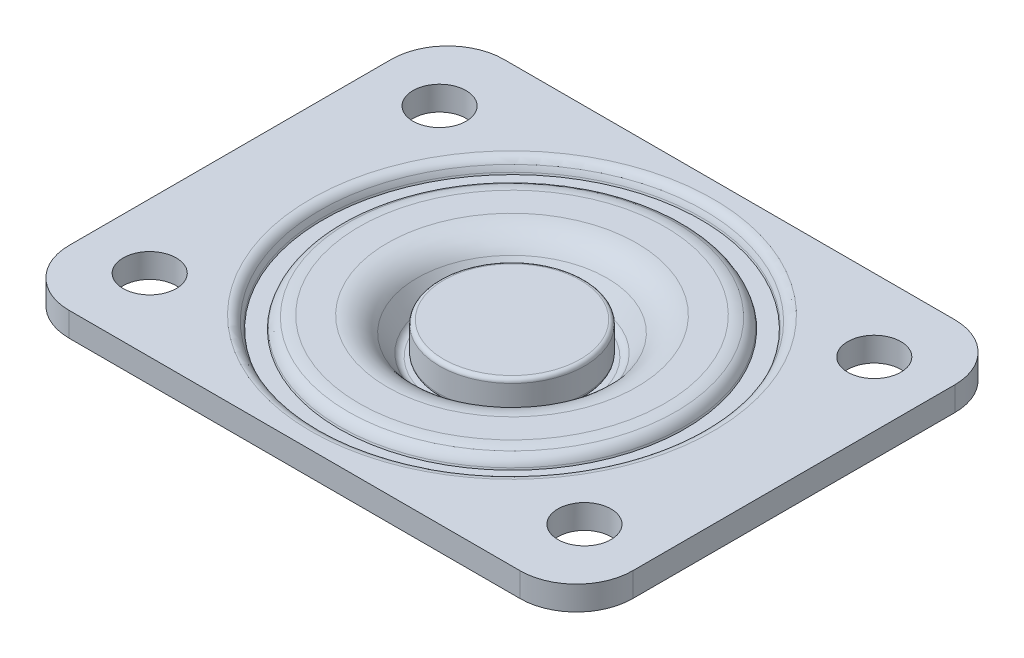
ISO-10303-21;
HEADER;
FILE_DESCRIPTION(('STEP AP214'),'2;1');
FILE_NAME('part.step','',(''),(''),'','','');
FILE_SCHEMA(('AUTOMOTIVE_DESIGN { 1 0 10303 214 1 1 1 1 }'));
ENDSEC;
DATA;
#1=APPLICATION_CONTEXT('core data for automotive mechanical design processes');
#2=APPLICATION_PROTOCOL_DEFINITION('international standard','automotive_design',2000,#1);
#3=PRODUCT_CONTEXT('',#1,'mechanical');
#4=PRODUCT('Part','Part','',(#3));
#5=PRODUCT_RELATED_PRODUCT_CATEGORY('part','',(#4));
#6=PRODUCT_DEFINITION_FORMATION('','',#4);
#7=PRODUCT_DEFINITION_CONTEXT('part definition',#1,'design');
#8=PRODUCT_DEFINITION('design','',#6,#7);
#9=PRODUCT_DEFINITION_SHAPE('','',#8);
#10=(LENGTH_UNIT() NAMED_UNIT(*) SI_UNIT(.MILLI.,.METRE.));
#11=(NAMED_UNIT(*) PLANE_ANGLE_UNIT() SI_UNIT($,.RADIAN.));
#12=(NAMED_UNIT(*) SI_UNIT($,.STERADIAN.) SOLID_ANGLE_UNIT());
#13=UNCERTAINTY_MEASURE_WITH_UNIT(LENGTH_MEASURE(1.E-05),#10,'distance_accuracy_value','');
#14=(GEOMETRIC_REPRESENTATION_CONTEXT(3) GLOBAL_UNCERTAINTY_ASSIGNED_CONTEXT((#13)) GLOBAL_UNIT_ASSIGNED_CONTEXT((#10,
#11,#12)) REPRESENTATION_CONTEXT('',''));
#15=CARTESIAN_POINT('',(0.,0.,0.));
#16=DIRECTION('',(0.,0.,1.));
#17=DIRECTION('',(1.,0.,0.));
#18=AXIS2_PLACEMENT_3D('',#15,#16,#17);
#19=CARTESIAN_POINT('',(0.,3.,0.));
#20=DIRECTION('',(0.,-1.,0.));
#21=DIRECTION('',(0.,0.,-1.));
#22=AXIS2_PLACEMENT_3D('',#19,#20,#21);
#23=PLANE('',#22);
#24=CARTESIAN_POINT('',(-27.,3.,18.));
#25=DIRECTION('',(0.,1.,0.));
#26=DIRECTION('',(0.,0.,1.));
#27=AXIS2_PLACEMENT_3D('',#24,#25,#26);
#28=CIRCLE('',#27,3.3);
#29=CARTESIAN_POINT('',(-27.,3.,21.3));
#30=VERTEX_POINT('',#29);
#31=EDGE_CURVE('E193',#30,#30,#28,.T.);
#32=ORIENTED_EDGE('',*,*,#31,.F.);
#33=EDGE_LOOP('',(#32));
#34=FACE_BOUND('',#33,.T.);
#35=CARTESIAN_POINT('',(27.,3.,18.));
#36=DIRECTION('',(0.,1.,0.));
#37=DIRECTION('',(0.,0.,1.));
#38=AXIS2_PLACEMENT_3D('',#35,#36,#37);
#39=CIRCLE('',#38,3.3);
#40=CARTESIAN_POINT('',(27.,3.,21.3));
#41=VERTEX_POINT('',#40);
#42=EDGE_CURVE('E189',#41,#41,#39,.T.);
#43=ORIENTED_EDGE('',*,*,#42,.F.);
#44=EDGE_LOOP('',(#43));
#45=FACE_BOUND('',#44,.T.);
#46=CARTESIAN_POINT('',(27.,3.,-18.));
#47=DIRECTION('',(0.,1.,0.));
#48=DIRECTION('',(0.,0.,1.));
#49=AXIS2_PLACEMENT_3D('',#46,#47,#48);
#50=CIRCLE('',#49,3.3);
#51=CARTESIAN_POINT('',(27.,3.,-14.7));
#52=VERTEX_POINT('',#51);
#53=EDGE_CURVE('E185',#52,#52,#50,.T.);
#54=ORIENTED_EDGE('',*,*,#53,.F.);
#55=EDGE_LOOP('',(#54));
#56=FACE_BOUND('',#55,.T.);
#57=CARTESIAN_POINT('',(-27.,3.,-18.));
#58=DIRECTION('',(0.,1.,0.));
#59=DIRECTION('',(0.,0.,1.));
#60=AXIS2_PLACEMENT_3D('',#57,#58,#59);
#61=CIRCLE('',#60,3.3);
#62=CARTESIAN_POINT('',(-27.,3.,-14.7));
#63=VERTEX_POINT('',#62);
#64=EDGE_CURVE('E181',#63,#63,#61,.T.);
#65=ORIENTED_EDGE('',*,*,#64,.F.);
#66=EDGE_LOOP('',(#65));
#67=FACE_BOUND('',#66,.T.);
#68=DIRECTION('',(0.,0.,-1.));
#69=VECTOR('',#68,1.);
#70=CARTESIAN_POINT('',(35.,3.,27.));
#71=LINE('',#70,#69);
#72=CARTESIAN_POINT('',(35.,3.,20.));
#73=VERTEX_POINT('',#72);
#74=CARTESIAN_POINT('',(35.,3.,-20.));
#75=VERTEX_POINT('',#74);
#76=EDGE_CURVE('E139',#73,#75,#71,.T.);
#77=ORIENTED_EDGE('',*,*,#76,.T.);
#78=CARTESIAN_POINT('',(28.,3.,-20.));
#79=DIRECTION('',(0.,-1.,0.));
#80=DIRECTION('',(0.,0.,-1.));
#81=AXIS2_PLACEMENT_3D('',#78,#79,#80);
#82=CIRCLE('',#81,7.);
#83=CARTESIAN_POINT('',(28.,3.,-27.));
#84=VERTEX_POINT('',#83);
#85=EDGE_CURVE('E165',#75,#84,#82,.F.);
#86=ORIENTED_EDGE('',*,*,#85,.T.);
#87=DIRECTION('',(-1.,0.,0.));
#88=VECTOR('',#87,1.);
#89=CARTESIAN_POINT('',(-35.,3.,-27.));
#90=LINE('',#89,#88);
#91=CARTESIAN_POINT('',(-28.,3.,-27.));
#92=VERTEX_POINT('',#91);
#93=EDGE_CURVE('E121',#84,#92,#90,.T.);
#94=ORIENTED_EDGE('',*,*,#93,.T.);
#95=CARTESIAN_POINT('',(-28.,3.,-20.));
#96=DIRECTION('',(0.,-1.,0.));
#97=DIRECTION('',(0.,0.,-1.));
#98=AXIS2_PLACEMENT_3D('',#95,#96,#97);
#99=CIRCLE('',#98,7.);
#100=CARTESIAN_POINT('',(-35.,3.,-20.));
#101=VERTEX_POINT('',#100);
#102=EDGE_CURVE('E161',#92,#101,#99,.F.);
#103=ORIENTED_EDGE('',*,*,#102,.T.);
#104=DIRECTION('',(0.,0.,1.));
#105=VECTOR('',#104,1.);
#106=CARTESIAN_POINT('',(-35.,3.,27.));
#107=LINE('',#106,#105);
#108=CARTESIAN_POINT('',(-35.,3.,20.));
#109=VERTEX_POINT('',#108);
#110=EDGE_CURVE('E307',#101,#109,#107,.T.);
#111=ORIENTED_EDGE('',*,*,#110,.T.);
#112=CARTESIAN_POINT('',(-28.,3.,20.));
#113=DIRECTION('',(0.,-1.,0.));
#114=DIRECTION('',(0.,0.,-1.));
#115=AXIS2_PLACEMENT_3D('',#112,#113,#114);
#116=CIRCLE('',#115,7.);
#117=CARTESIAN_POINT('',(-28.,3.,27.));
#118=VERTEX_POINT('',#117);
#119=EDGE_CURVE('E56',#109,#118,#116,.F.);
#120=ORIENTED_EDGE('',*,*,#119,.T.);
#121=DIRECTION('',(1.,0.,0.));
#122=VECTOR('',#121,1.);
#123=CARTESIAN_POINT('',(-35.,3.,27.));
#124=LINE('',#123,#122);
#125=CARTESIAN_POINT('',(28.,3.,27.));
#126=VERTEX_POINT('',#125);
#127=EDGE_CURVE('E144',#118,#126,#124,.T.);
#128=ORIENTED_EDGE('',*,*,#127,.T.);
#129=CARTESIAN_POINT('',(28.,3.,20.));
#130=DIRECTION('',(0.,-1.,0.));
#131=DIRECTION('',(0.,0.,-1.));
#132=AXIS2_PLACEMENT_3D('',#129,#130,#131);
#133=CIRCLE('',#132,7.);
#134=EDGE_CURVE('E163',#126,#73,#133,.F.);
#135=ORIENTED_EDGE('',*,*,#134,.T.);
#136=EDGE_LOOP('',(#77,#86,#94,#103,#111,#120,#128,#135));
#137=FACE_BOUND('',#136,.T.);
#138=CARTESIAN_POINT('',(0.,3.,0.));
#139=DIRECTION('',(0.,1.,0.));
#140=DIRECTION('',(0.,0.,1.));
#141=AXIS2_PLACEMENT_3D('',#138,#139,#140);
#142=CIRCLE('',#141,24.987277463445);
#143=CARTESIAN_POINT('',(0.,3.,24.987277463445));
#144=VERTEX_POINT('',#143);
#145=EDGE_CURVE('E264',#144,#144,#142,.T.);
#146=ORIENTED_EDGE('',*,*,#145,.F.);
#147=EDGE_LOOP('',(#146));
#148=FACE_BOUND('',#147,.T.);
#149=ADVANCED_FACE('F34',(#34,#45,#56,#67,#137,#148),#23,.F.);
#150=CARTESIAN_POINT('',(0.,0.,0.));
#151=DIRECTION('',(0.,-1.,0.));
#152=DIRECTION('',(0.,0.,-1.));
#153=AXIS2_PLACEMENT_3D('',#150,#151,#152);
#154=PLANE('',#153);
#155=CARTESIAN_POINT('',(0.,0.,0.));
#156=DIRECTION('',(0.,-1.,0.));
#157=DIRECTION('',(0.,0.,-1.));
#158=AXIS2_PLACEMENT_3D('',#155,#156,#157);
#159=CIRCLE('',#158,20.0013248654052);
#160=CARTESIAN_POINT('',(0.,0.,-20.0013248654052));
#161=VERTEX_POINT('',#160);
#162=EDGE_CURVE('E214',#161,#161,#159,.T.);
#163=ORIENTED_EDGE('',*,*,#162,.T.);
#164=EDGE_LOOP('',(#163));
#165=FACE_BOUND('',#164,.T.);
#166=CARTESIAN_POINT('',(0.,0.,0.));
#167=DIRECTION('',(0.,-1.,0.));
#168=DIRECTION('',(0.,0.,-1.));
#169=AXIS2_PLACEMENT_3D('',#166,#167,#168);
#170=CIRCLE('',#169,15.5308505758276);
#171=CARTESIAN_POINT('',(0.,0.,-15.5308505758276));
#172=VERTEX_POINT('',#171);
#173=EDGE_CURVE('E150',#172,#172,#170,.F.);
#174=ORIENTED_EDGE('',*,*,#173,.T.);
#175=EDGE_LOOP('',(#174));
#176=FACE_BOUND('',#175,.T.);
#177=ADVANCED_FACE('F231',(#165,#176),#154,.T.);
#178=CARTESIAN_POINT('',(-5.,-15.5,0.));
#179=DIRECTION('',(0.,1.,0.));
#180=DIRECTION('',(0.,0.,1.));
#181=AXIS2_PLACEMENT_3D('',#178,#179,#180);
#182=PLANE('',#181);
#183=CARTESIAN_POINT('',(0.,-15.5,0.));
#184=DIRECTION('',(0.,-1.,0.));
#185=DIRECTION('',(0.,0.,-1.));
#186=AXIS2_PLACEMENT_3D('',#183,#184,#185);
#187=CIRCLE('',#186,5.);
#188=CARTESIAN_POINT('',(0.,-15.5,-5.));
#189=VERTEX_POINT('',#188);
#190=EDGE_CURVE('E134',#189,#189,#187,.T.);
#191=ORIENTED_EDGE('',*,*,#190,.T.);
#192=EDGE_LOOP('',(#191));
#193=FACE_BOUND('',#192,.T.);
#194=ADVANCED_FACE('F238',(#193),#182,.F.);
#195=CARTESIAN_POINT('',(0.,-15.5,0.));
#196=DIRECTION('',(0.,-1.,0.));
#197=DIRECTION('',(0.,0.,-1.));
#198=AXIS2_PLACEMENT_3D('',#195,#196,#197);
#199=CYLINDRICAL_SURFACE('',#198,5.);
#200=ORIENTED_EDGE('',*,*,#190,.F.);
#201=EDGE_LOOP('',(#200));
#202=FACE_BOUND('',#201,.T.);
#203=CARTESIAN_POINT('',(0.,-4.5,0.));
#204=DIRECTION('',(0.,-1.,0.));
#205=DIRECTION('',(0.,0.,-1.));
#206=AXIS2_PLACEMENT_3D('',#203,#204,#205);
#207=CIRCLE('',#206,5.);
#208=CARTESIAN_POINT('',(0.,-4.5,-5.));
#209=VERTEX_POINT('',#208);
#210=EDGE_CURVE('E299',#209,#209,#207,.T.);
#211=ORIENTED_EDGE('',*,*,#210,.T.);
#212=EDGE_LOOP('',(#211));
#213=FACE_BOUND('',#212,.T.);
#214=ADVANCED_FACE('F395',(#202,#213),#199,.T.);
#215=CARTESIAN_POINT('',(-11.5990660780563,-4.5,0.));
#216=DIRECTION('',(0.,1.,0.));
#217=DIRECTION('',(0.,0.,1.));
#218=AXIS2_PLACEMENT_3D('',#215,#216,#217);
#219=PLANE('',#218);
#220=CARTESIAN_POINT('',(0.,-4.5,0.));
#221=DIRECTION('',(0.,1.,0.));
#222=DIRECTION('',(0.,0.,1.));
#223=AXIS2_PLACEMENT_3D('',#220,#221,#222);
#224=CIRCLE('',#223,9.51679787584933);
#225=CARTESIAN_POINT('',(0.,-4.5,9.51679787584933));
#226=VERTEX_POINT('',#225);
#227=EDGE_CURVE('E140',#226,#226,#224,.F.);
#228=ORIENTED_EDGE('',*,*,#227,.T.);
#229=EDGE_LOOP('',(#228));
#230=FACE_BOUND('',#229,.T.);
#231=ORIENTED_EDGE('',*,*,#210,.F.);
#232=EDGE_LOOP('',(#231));
#233=FACE_BOUND('',#232,.T.);
#234=ADVANCED_FACE('F391',(#230,#233),#219,.F.);
#235=CARTESIAN_POINT('',(0.,0.,0.));
#236=DIRECTION('',(0.,1.,0.));
#237=DIRECTION('',(0.,0.,1.));
#238=AXIS2_PLACEMENT_3D('',#235,#236,#237);
#239=CONICAL_SURFACE('',#238,14.75,0.610865238198013);
#240=CARTESIAN_POINT('',(0.,-0.639635345473434,0.));
#241=DIRECTION('',(0.,-1.,0.));
#242=DIRECTION('',(0.,0.,-1.));
#243=AXIS2_PLACEMENT_3D('',#240,#241,#242);
#244=CIRCLE('',#243,14.3021225093941);
#245=CARTESIAN_POINT('',(0.,-0.639635345473434,-14.3021225093941));
#246=VERTEX_POINT('',#245);
#247=EDGE_CURVE('E147',#246,#246,#244,.T.);
#248=ORIENTED_EDGE('',*,*,#247,.T.);
#249=EDGE_LOOP('',(#248));
#250=FACE_BOUND('',#249,.T.);
#251=CARTESIAN_POINT('',(0.,-2.79430574540418,0.));
#252=DIRECTION('',(0.,-1.,0.));
#253=DIRECTION('',(0.,0.,-1.));
#254=AXIS2_PLACEMENT_3D('',#251,#252,#253);
#255=CIRCLE('',#254,12.7934060530053);
#256=CARTESIAN_POINT('',(0.,-2.79430574540418,-12.7934060530053));
#257=VERTEX_POINT('',#256);
#258=EDGE_CURVE('E143',#257,#257,#255,.F.);
#259=ORIENTED_EDGE('',*,*,#258,.T.);
#260=EDGE_LOOP('',(#259));
#261=FACE_BOUND('',#260,.T.);
#262=ADVANCED_FACE('F387',(#250,#261),#239,.T.);
#263=CARTESIAN_POINT('',(0.,-0.5,0.));
#264=DIRECTION('',(0.,1.,0.));
#265=DIRECTION('',(0.,0.,1.));
#266=AXIS2_PLACEMENT_3D('',#263,#264,#265);
#267=TOROIDAL_SURFACE('',#266,9.51679787584933,4.);
#268=ORIENTED_EDGE('',*,*,#258,.F.);
#269=EDGE_LOOP('',(#268));
#270=FACE_BOUND('',#269,.T.);
#271=ORIENTED_EDGE('',*,*,#227,.F.);
#272=EDGE_LOOP('',(#271));
#273=FACE_BOUND('',#272,.T.);
#274=ADVANCED_FACE('F390',(#270,#273),#267,.T.);
#275=CARTESIAN_POINT('',(0.,-1.5,0.));
#276=DIRECTION('',(0.,-1.,0.));
#277=DIRECTION('',(0.,0.,-1.));
#278=AXIS2_PLACEMENT_3D('',#275,#276,#277);
#279=TOROIDAL_SURFACE('',#278,15.5308505758276,1.5);
#280=ORIENTED_EDGE('',*,*,#173,.F.);
#281=EDGE_LOOP('',(#280));
#282=FACE_BOUND('',#281,.T.);
#283=ORIENTED_EDGE('',*,*,#247,.F.);
#284=EDGE_LOOP('',(#283));
#285=FACE_BOUND('',#284,.T.);
#286=ADVANCED_FACE('F385',(#282,#285),#279,.F.);
#287=CARTESIAN_POINT('',(0.,0.,0.));
#288=DIRECTION('',(0.,-1.,0.));
#289=DIRECTION('',(0.,0.,-1.));
#290=AXIS2_PLACEMENT_3D('',#287,#288,#289);
#291=CONICAL_SURFACE('',#290,20.29,0.523598775598298);
#292=CARTESIAN_POINT('',(0.,-0.249999999999993,0.));
#293=DIRECTION('',(0.,1.,0.));
#294=DIRECTION('',(0.,0.,1.));
#295=AXIS2_PLACEMENT_3D('',#292,#293,#294);
#296=CIRCLE('',#295,20.4343375672974);
#297=CARTESIAN_POINT('',(0.,-0.249999999999993,20.4343375672974));
#298=VERTEX_POINT('',#297);
#299=EDGE_CURVE('E211',#298,#298,#296,.T.);
#300=ORIENTED_EDGE('',*,*,#299,.T.);
#301=EDGE_LOOP('',(#300));
#302=FACE_BOUND('',#301,.T.);
#303=CARTESIAN_POINT('',(0.,-0.367473300878593,0.));
#304=DIRECTION('',(0.,1.,0.));
#305=DIRECTION('',(0.,0.,1.));
#306=AXIS2_PLACEMENT_3D('',#303,#304,#305);
#307=CIRCLE('',#306,20.5021608091823);
#308=CARTESIAN_POINT('',(0.,-0.367473300878593,20.5021608091823));
#309=VERTEX_POINT('',#308);
#310=EDGE_CURVE('E296',#309,#309,#307,.T.);
#311=ORIENTED_EDGE('',*,*,#310,.F.);
#312=EDGE_LOOP('',(#311));
#313=FACE_BOUND('',#312,.T.);
#314=ADVANCED_FACE('F381',(#302,#313),#291,.F.);
#315=CARTESIAN_POINT('',(0.,0.797526699121403,0.));
#316=DIRECTION('',(0.,1.,0.));
#317=DIRECTION('',(0.,0.,1.));
#318=AXIS2_PLACEMENT_3D('',#315,#316,#317);
#319=TOROIDAL_SURFACE('',#318,22.52,2.33);
#320=CARTESIAN_POINT('',(0.,-0.367473300878607,0.));
#321=DIRECTION('',(0.,1.,0.));
#322=DIRECTION('',(0.,0.,1.));
#323=AXIS2_PLACEMENT_3D('',#320,#321,#322);
#324=CIRCLE('',#323,24.5378391908177);
#325=CARTESIAN_POINT('',(0.,-0.367473300878607,24.5378391908177));
#326=VERTEX_POINT('',#325);
#327=EDGE_CURVE('E293',#326,#326,#324,.T.);
#328=ORIENTED_EDGE('',*,*,#327,.F.);
#329=EDGE_LOOP('',(#328));
#330=FACE_BOUND('',#329,.T.);
#331=ORIENTED_EDGE('',*,*,#310,.T.);
#332=EDGE_LOOP('',(#331));
#333=FACE_BOUND('',#332,.T.);
#334=ADVANCED_FACE('F337',(#330,#333),#319,.T.);
#335=CARTESIAN_POINT('',(0.,-0.367473300878607,0.));
#336=DIRECTION('',(0.,1.,0.));
#337=DIRECTION('',(0.,0.,1.));
#338=AXIS2_PLACEMENT_3D('',#335,#336,#337);
#339=CONICAL_SURFACE('',#338,24.5378391908177,0.523598775598302);
#340=CARTESIAN_POINT('',(0.,-0.25,0.));
#341=DIRECTION('',(0.,-1.,0.));
#342=DIRECTION('',(0.,0.,-1.));
#343=AXIS2_PLACEMENT_3D('',#340,#341,#342);
#344=CIRCLE('',#343,24.6056624327026);
#345=CARTESIAN_POINT('',(0.,-0.25,-24.6056624327026));
#346=VERTEX_POINT('',#345);
#347=EDGE_CURVE('E11',#346,#346,#344,.T.);
#348=ORIENTED_EDGE('',*,*,#347,.T.);
#349=EDGE_LOOP('',(#348));
#350=FACE_BOUND('',#349,.T.);
#351=ORIENTED_EDGE('',*,*,#327,.T.);
#352=EDGE_LOOP('',(#351));
#353=FACE_BOUND('',#352,.T.);
#354=ADVANCED_FACE('F330',(#350,#353),#339,.T.);
#355=CARTESIAN_POINT('',(-28.,3.,-20.));
#356=DIRECTION('',(0.,-1.,0.));
#357=DIRECTION('',(0.,0.,-1.));
#358=AXIS2_PLACEMENT_3D('',#355,#356,#357);
#359=CYLINDRICAL_SURFACE('',#358,7.);
#360=ORIENTED_EDGE('',*,*,#102,.F.);
#361=DIRECTION('',(0.,-1.,0.));
#362=VECTOR('',#361,1.);
#363=CARTESIAN_POINT('',(-28.,3.,-27.));
#364=LINE('',#363,#362);
#365=CARTESIAN_POINT('',(-28.,0.,-27.));
#366=VERTEX_POINT('',#365);
#367=EDGE_CURVE('E123',#366,#92,#364,.F.);
#368=ORIENTED_EDGE('',*,*,#367,.F.);
#369=CARTESIAN_POINT('',(-28.,0.,-20.));
#370=DIRECTION('',(0.,-1.,0.));
#371=DIRECTION('',(0.,0.,-1.));
#372=AXIS2_PLACEMENT_3D('',#369,#370,#371);
#373=CIRCLE('',#372,7.);
#374=CARTESIAN_POINT('',(-35.,0.,-20.));
#375=VERTEX_POINT('',#374);
#376=EDGE_CURVE('E127',#375,#366,#373,.T.);
#377=ORIENTED_EDGE('',*,*,#376,.F.);
#378=DIRECTION('',(0.,-1.,0.));
#379=VECTOR('',#378,1.);
#380=CARTESIAN_POINT('',(-35.,3.,-20.));
#381=LINE('',#380,#379);
#382=EDGE_CURVE('E173',#101,#375,#381,.T.);
#383=ORIENTED_EDGE('',*,*,#382,.F.);
#384=EDGE_LOOP('',(#360,#368,#377,#383));
#385=FACE_BOUND('',#384,.T.);
#386=ADVANCED_FACE('F328',(#385),#359,.T.);
#387=CARTESIAN_POINT('',(-35.,3.,27.));
#388=DIRECTION('',(1.,0.,0.));
#389=DIRECTION('',(0.,0.,-1.));
#390=AXIS2_PLACEMENT_3D('',#387,#388,#389);
#391=PLANE('',#390);
#392=ORIENTED_EDGE('',*,*,#110,.F.);
#393=ORIENTED_EDGE('',*,*,#382,.T.);
#394=DIRECTION('',(0.,0.,1.));
#395=VECTOR('',#394,1.);
#396=CARTESIAN_POINT('',(-35.,0.,27.));
#397=LINE('',#396,#395);
#398=CARTESIAN_POINT('',(-35.,0.,20.));
#399=VERTEX_POINT('',#398);
#400=EDGE_CURVE('E128',#375,#399,#397,.T.);
#401=ORIENTED_EDGE('',*,*,#400,.T.);
#402=DIRECTION('',(0.,-1.,0.));
#403=VECTOR('',#402,1.);
#404=CARTESIAN_POINT('',(-35.,3.,20.));
#405=LINE('',#404,#403);
#406=EDGE_CURVE('E171',#399,#109,#405,.F.);
#407=ORIENTED_EDGE('',*,*,#406,.T.);
#408=EDGE_LOOP('',(#392,#393,#401,#407));
#409=FACE_BOUND('',#408,.T.);
#410=ADVANCED_FACE('F324',(#409),#391,.F.);
#411=CARTESIAN_POINT('',(-28.,3.,20.));
#412=DIRECTION('',(0.,-1.,0.));
#413=DIRECTION('',(0.,0.,-1.));
#414=AXIS2_PLACEMENT_3D('',#411,#412,#413);
#415=CYLINDRICAL_SURFACE('',#414,7.);
#416=ORIENTED_EDGE('',*,*,#119,.F.);
#417=ORIENTED_EDGE('',*,*,#406,.F.);
#418=CARTESIAN_POINT('',(-28.,0.,20.));
#419=DIRECTION('',(0.,-1.,0.));
#420=DIRECTION('',(0.,0.,-1.));
#421=AXIS2_PLACEMENT_3D('',#418,#419,#420);
#422=CIRCLE('',#421,7.);
#423=CARTESIAN_POINT('',(-28.,0.,27.));
#424=VERTEX_POINT('',#423);
#425=EDGE_CURVE('E122',#424,#399,#422,.T.);
#426=ORIENTED_EDGE('',*,*,#425,.F.);
#427=DIRECTION('',(0.,-1.,0.));
#428=VECTOR('',#427,1.);
#429=CARTESIAN_POINT('',(-28.,3.,27.));
#430=LINE('',#429,#428);
#431=EDGE_CURVE('E167',#118,#424,#430,.T.);
#432=ORIENTED_EDGE('',*,*,#431,.F.);
#433=EDGE_LOOP('',(#416,#417,#426,#432));
#434=FACE_BOUND('',#433,.T.);
#435=ADVANCED_FACE('F320',(#434),#415,.T.);
#436=CARTESIAN_POINT('',(-35.,3.,27.));
#437=DIRECTION('',(0.,0.,-1.));
#438=DIRECTION('',(-1.,0.,0.));
#439=AXIS2_PLACEMENT_3D('',#436,#437,#438);
#440=PLANE('',#439);
#441=DIRECTION('',(1.,0.,0.));
#442=VECTOR('',#441,1.);
#443=CARTESIAN_POINT('',(-35.,0.,27.));
#444=LINE('',#443,#442);
#445=CARTESIAN_POINT('',(28.,0.,27.));
#446=VERTEX_POINT('',#445);
#447=EDGE_CURVE('E132',#424,#446,#444,.T.);
#448=ORIENTED_EDGE('',*,*,#447,.T.);
#449=DIRECTION('',(0.,-1.,0.));
#450=VECTOR('',#449,1.);
#451=CARTESIAN_POINT('',(28.,3.,27.));
#452=LINE('',#451,#450);
#453=EDGE_CURVE('E49',#446,#126,#452,.F.);
#454=ORIENTED_EDGE('',*,*,#453,.T.);
#455=ORIENTED_EDGE('',*,*,#127,.F.);
#456=ORIENTED_EDGE('',*,*,#431,.T.);
#457=EDGE_LOOP('',(#448,#454,#455,#456));
#458=FACE_BOUND('',#457,.T.);
#459=ADVANCED_FACE('F318',(#458),#440,.F.);
#460=CARTESIAN_POINT('',(28.,3.,20.));
#461=DIRECTION('',(0.,-1.,0.));
#462=DIRECTION('',(0.,0.,-1.));
#463=AXIS2_PLACEMENT_3D('',#460,#461,#462);
#464=CYLINDRICAL_SURFACE('',#463,7.);
#465=ORIENTED_EDGE('',*,*,#134,.F.);
#466=ORIENTED_EDGE('',*,*,#453,.F.);
#467=CARTESIAN_POINT('',(28.,0.,20.));
#468=DIRECTION('',(0.,-1.,0.));
#469=DIRECTION('',(0.,0.,-1.));
#470=AXIS2_PLACEMENT_3D('',#467,#468,#469);
#471=CIRCLE('',#470,7.);
#472=CARTESIAN_POINT('',(35.,0.,20.));
#473=VERTEX_POINT('',#472);
#474=EDGE_CURVE('E112',#473,#446,#471,.T.);
#475=ORIENTED_EDGE('',*,*,#474,.F.);
#476=DIRECTION('',(0.,-1.,0.));
#477=VECTOR('',#476,1.);
#478=CARTESIAN_POINT('',(35.,3.,20.));
#479=LINE('',#478,#477);
#480=EDGE_CURVE('E111',#73,#473,#479,.T.);
#481=ORIENTED_EDGE('',*,*,#480,.F.);
#482=EDGE_LOOP('',(#465,#466,#475,#481));
#483=FACE_BOUND('',#482,.T.);
#484=ADVANCED_FACE('F314',(#483),#464,.T.);
#485=CARTESIAN_POINT('',(35.,3.,27.));
#486=DIRECTION('',(-1.,0.,0.));
#487=DIRECTION('',(0.,0.,1.));
#488=AXIS2_PLACEMENT_3D('',#485,#486,#487);
#489=PLANE('',#488);
#490=DIRECTION('',(0.,0.,-1.));
#491=VECTOR('',#490,1.);
#492=CARTESIAN_POINT('',(35.,0.,27.));
#493=LINE('',#492,#491);
#494=CARTESIAN_POINT('',(35.,0.,-20.));
#495=VERTEX_POINT('',#494);
#496=EDGE_CURVE('E129',#473,#495,#493,.T.);
#497=ORIENTED_EDGE('',*,*,#496,.T.);
#498=DIRECTION('',(0.,-1.,0.));
#499=VECTOR('',#498,1.);
#500=CARTESIAN_POINT('',(35.,3.,-20.));
#501=LINE('',#500,#499);
#502=EDGE_CURVE('E106',#495,#75,#501,.F.);
#503=ORIENTED_EDGE('',*,*,#502,.T.);
#504=ORIENTED_EDGE('',*,*,#76,.F.);
#505=ORIENTED_EDGE('',*,*,#480,.T.);
#506=EDGE_LOOP('',(#497,#503,#504,#505));
#507=FACE_BOUND('',#506,.T.);
#508=ADVANCED_FACE('F316',(#507),#489,.F.);
#509=CARTESIAN_POINT('',(28.,3.,-20.));
#510=DIRECTION('',(0.,-1.,0.));
#511=DIRECTION('',(0.,0.,-1.));
#512=AXIS2_PLACEMENT_3D('',#509,#510,#511);
#513=CYLINDRICAL_SURFACE('',#512,7.);
#514=ORIENTED_EDGE('',*,*,#85,.F.);
#515=ORIENTED_EDGE('',*,*,#502,.F.);
#516=CARTESIAN_POINT('',(28.,0.,-20.));
#517=DIRECTION('',(0.,-1.,0.));
#518=DIRECTION('',(0.,0.,-1.));
#519=AXIS2_PLACEMENT_3D('',#516,#517,#518);
#520=CIRCLE('',#519,7.);
#521=CARTESIAN_POINT('',(28.,0.,-27.));
#522=VERTEX_POINT('',#521);
#523=EDGE_CURVE('E101',#522,#495,#520,.T.);
#524=ORIENTED_EDGE('',*,*,#523,.F.);
#525=DIRECTION('',(0.,-1.,0.));
#526=VECTOR('',#525,1.);
#527=CARTESIAN_POINT('',(28.,3.,-27.));
#528=LINE('',#527,#526);
#529=EDGE_CURVE('E105',#84,#522,#528,.T.);
#530=ORIENTED_EDGE('',*,*,#529,.F.);
#531=EDGE_LOOP('',(#514,#515,#524,#530));
#532=FACE_BOUND('',#531,.T.);
#533=ADVANCED_FACE('F104',(#532),#513,.T.);
#534=CARTESIAN_POINT('',(-35.,3.,-27.));
#535=DIRECTION('',(0.,0.,1.));
#536=DIRECTION('',(1.,0.,0.));
#537=AXIS2_PLACEMENT_3D('',#534,#535,#536);
#538=PLANE('',#537);
#539=ORIENTED_EDGE('',*,*,#93,.F.);
#540=ORIENTED_EDGE('',*,*,#529,.T.);
#541=DIRECTION('',(-1.,0.,0.));
#542=VECTOR('',#541,1.);
#543=CARTESIAN_POINT('',(-35.,0.,-27.));
#544=LINE('',#543,#542);
#545=EDGE_CURVE('E118',#522,#366,#544,.T.);
#546=ORIENTED_EDGE('',*,*,#545,.T.);
#547=ORIENTED_EDGE('',*,*,#367,.T.);
#548=EDGE_LOOP('',(#539,#540,#546,#547));
#549=FACE_BOUND('',#548,.T.);
#550=ADVANCED_FACE('F117',(#549),#538,.F.);
#551=CARTESIAN_POINT('',(0.,0.,0.));
#552=DIRECTION('',(0.,-1.,0.));
#553=DIRECTION('',(0.,0.,-1.));
#554=AXIS2_PLACEMENT_3D('',#551,#552,#553);
#555=CIRCLE('',#554,25.0386751345948);
#556=CARTESIAN_POINT('',(0.,0.,-25.0386751345948));
#557=VERTEX_POINT('',#556);
#558=EDGE_CURVE('E42',#557,#557,#555,.F.);
#559=ORIENTED_EDGE('',*,*,#558,.T.);
#560=EDGE_LOOP('',(#559));
#561=FACE_BOUND('',#560,.T.);
#562=CARTESIAN_POINT('',(-27.,0.,18.));
#563=DIRECTION('',(0.,-1.,0.));
#564=DIRECTION('',(0.,0.,-1.));
#565=AXIS2_PLACEMENT_3D('',#562,#563,#564);
#566=CIRCLE('',#565,3.3);
#567=CARTESIAN_POINT('',(-27.,0.,14.7));
#568=VERTEX_POINT('',#567);
#569=EDGE_CURVE('E190',#568,#568,#566,.T.);
#570=ORIENTED_EDGE('',*,*,#569,.F.);
#571=EDGE_LOOP('',(#570));
#572=FACE_BOUND('',#571,.T.);
#573=CARTESIAN_POINT('',(27.,0.,18.));
#574=DIRECTION('',(0.,-1.,0.));
#575=DIRECTION('',(0.,0.,-1.));
#576=AXIS2_PLACEMENT_3D('',#573,#574,#575);
#577=CIRCLE('',#576,3.3);
#578=CARTESIAN_POINT('',(27.,0.,14.7));
#579=VERTEX_POINT('',#578);
#580=EDGE_CURVE('E186',#579,#579,#577,.T.);
#581=ORIENTED_EDGE('',*,*,#580,.F.);
#582=EDGE_LOOP('',(#581));
#583=FACE_BOUND('',#582,.T.);
#584=CARTESIAN_POINT('',(27.,0.,-18.));
#585=DIRECTION('',(0.,-1.,0.));
#586=DIRECTION('',(0.,0.,-1.));
#587=AXIS2_PLACEMENT_3D('',#584,#585,#586);
#588=CIRCLE('',#587,3.3);
#589=CARTESIAN_POINT('',(27.,0.,-21.3));
#590=VERTEX_POINT('',#589);
#591=EDGE_CURVE('E182',#590,#590,#588,.T.);
#592=ORIENTED_EDGE('',*,*,#591,.F.);
#593=EDGE_LOOP('',(#592));
#594=FACE_BOUND('',#593,.T.);
#595=CARTESIAN_POINT('',(-27.,0.,-18.));
#596=DIRECTION('',(0.,-1.,0.));
#597=DIRECTION('',(0.,0.,-1.));
#598=AXIS2_PLACEMENT_3D('',#595,#596,#597);
#599=CIRCLE('',#598,3.3);
#600=CARTESIAN_POINT('',(-27.,0.,-21.3));
#601=VERTEX_POINT('',#600);
#602=EDGE_CURVE('E177',#601,#601,#599,.T.);
#603=ORIENTED_EDGE('',*,*,#602,.F.);
#604=EDGE_LOOP('',(#603));
#605=FACE_BOUND('',#604,.T.);
#606=ORIENTED_EDGE('',*,*,#545,.F.);
#607=ORIENTED_EDGE('',*,*,#523,.T.);
#608=ORIENTED_EDGE('',*,*,#496,.F.);
#609=ORIENTED_EDGE('',*,*,#474,.T.);
#610=ORIENTED_EDGE('',*,*,#447,.F.);
#611=ORIENTED_EDGE('',*,*,#425,.T.);
#612=ORIENTED_EDGE('',*,*,#400,.F.);
#613=ORIENTED_EDGE('',*,*,#376,.T.);
#614=EDGE_LOOP('',(#606,#607,#608,#609,#610,#611,#612,#613));
#615=FACE_BOUND('',#614,.T.);
#616=ADVANCED_FACE('F125',(#561,#572,#583,#594,#605,#615),#154,.T.);
#617=CARTESIAN_POINT('',(0.,1.1,0.));
#618=DIRECTION('',(0.,1.,0.));
#619=DIRECTION('',(0.,0.,1.));
#620=AXIS2_PLACEMENT_3D('',#617,#618,#619);
#621=TOROIDAL_SURFACE('',#620,19.75,1.77);
#622=CARTESIAN_POINT('',(0.,1.70537565368643,0.));
#623=DIRECTION('',(0.,1.,0.));
#624=DIRECTION('',(0.,0.,1.));
#625=AXIS2_PLACEMENT_3D('',#622,#623,#624);
#626=CIRCLE('',#625,21.4132559387911);
#627=CARTESIAN_POINT('',(0.,1.70537565368643,21.4132559387911));
#628=VERTEX_POINT('',#627);
#629=EDGE_CURVE('E284',#628,#628,#626,.T.);
#630=ORIENTED_EDGE('',*,*,#629,.T.);
#631=EDGE_LOOP('',(#630));
#632=FACE_BOUND('',#631,.T.);
#633=CARTESIAN_POINT('',(0.,2.76681614349776,0.));
#634=DIRECTION('',(0.,1.,0.));
#635=DIRECTION('',(0.,0.,1.));
#636=AXIS2_PLACEMENT_3D('',#633,#634,#635);
#637=CIRCLE('',#636,20.3455031013985);
#638=CARTESIAN_POINT('',(0.,2.76681614349776,20.3455031013985));
#639=VERTEX_POINT('',#638);
#640=EDGE_CURVE('E180',#639,#639,#637,.T.);
#641=ORIENTED_EDGE('',*,*,#640,.F.);
#642=EDGE_LOOP('',(#641));
#643=FACE_BOUND('',#642,.T.);
#644=ADVANCED_FACE('F459',(#632,#643),#621,.T.);
#645=CARTESIAN_POINT('',(0.,1.70537565368643,0.));
#646=DIRECTION('',(0.,-1.,0.));
#647=DIRECTION('',(0.,0.,-1.));
#648=AXIS2_PLACEMENT_3D('',#645,#646,#647);
#649=CONICAL_SURFACE('',#648,21.4132559387911,0.349065850398868);
#650=CARTESIAN_POINT('',(0.,1.5,0.));
#651=DIRECTION('',(0.,1.,0.));
#652=DIRECTION('',(0.,0.,1.));
#653=AXIS2_PLACEMENT_3D('',#650,#651,#652);
#654=CIRCLE('',#653,21.4880065635759);
#655=CARTESIAN_POINT('',(0.,1.5,21.4880065635759));
#656=VERTEX_POINT('',#655);
#657=EDGE_CURVE('E281',#656,#656,#654,.T.);
#658=ORIENTED_EDGE('',*,*,#657,.T.);
#659=EDGE_LOOP('',(#658));
#660=FACE_BOUND('',#659,.T.);
#661=ORIENTED_EDGE('',*,*,#629,.F.);
#662=EDGE_LOOP('',(#661));
#663=FACE_BOUND('',#662,.T.);
#664=ADVANCED_FACE('F573',(#660,#663),#649,.T.);
#665=CARTESIAN_POINT('',(0.,1.5,-21.4880065635759));
#666=DIRECTION('',(0.,1.,0.));
#667=DIRECTION('',(0.,0.,1.));
#668=AXIS2_PLACEMENT_3D('',#665,#666,#667);
#669=PLANE('',#668);
#670=CARTESIAN_POINT('',(0.,1.5,0.));
#671=DIRECTION('',(0.,1.,0.));
#672=DIRECTION('',(0.,0.,1.));
#673=AXIS2_PLACEMENT_3D('',#670,#671,#672);
#674=CIRCLE('',#673,23.4880065635759);
#675=CARTESIAN_POINT('',(0.,1.5,23.4880065635759));
#676=VERTEX_POINT('',#675);
#677=EDGE_CURVE('E278',#676,#676,#674,.T.);
#678=ORIENTED_EDGE('',*,*,#677,.T.);
#679=EDGE_LOOP('',(#678));
#680=FACE_BOUND('',#679,.T.);
#681=ORIENTED_EDGE('',*,*,#657,.F.);
#682=EDGE_LOOP('',(#681));
#683=FACE_BOUND('',#682,.T.);
#684=ADVANCED_FACE('F564',(#680,#683),#669,.T.);
#685=CARTESIAN_POINT('',(0.,1.5,0.));
#686=DIRECTION('',(0.,1.,0.));
#687=DIRECTION('',(0.,0.,1.));
#688=AXIS2_PLACEMENT_3D('',#685,#686,#687);
#689=CONICAL_SURFACE('',#688,23.4880065635759,0.349065850398892);
#690=CARTESIAN_POINT('',(0.,1.70332500483434,0.));
#691=DIRECTION('',(0.,1.,0.));
#692=DIRECTION('',(0.,0.,1.));
#693=AXIS2_PLACEMENT_3D('',#690,#691,#692);
#694=CIRCLE('',#693,23.5620108132176);
#695=CARTESIAN_POINT('',(0.,1.70332500483434,23.5620108132176));
#696=VERTEX_POINT('',#695);
#697=EDGE_CURVE('E275',#696,#696,#694,.T.);
#698=ORIENTED_EDGE('',*,*,#697,.T.);
#699=EDGE_LOOP('',(#698));
#700=FACE_BOUND('',#699,.T.);
#701=ORIENTED_EDGE('',*,*,#677,.F.);
#702=EDGE_LOOP('',(#701));
#703=FACE_BOUND('',#702,.T.);
#704=ADVANCED_FACE('F555',(#700,#703),#689,.F.);
#705=CARTESIAN_POINT('',(0.,0.26,0.));
#706=DIRECTION('',(0.,1.,0.));
#707=DIRECTION('',(0.,0.,1.));
#708=AXIS2_PLACEMENT_3D('',#705,#706,#707);
#709=TOROIDAL_SURFACE('',#708,27.5275136729341,4.22);
#710=CARTESIAN_POINT('',(0.,2.34109589041095,0.));
#711=DIRECTION('',(0.,1.,0.));
#712=DIRECTION('',(0.,0.,1.));
#713=AXIS2_PLACEMENT_3D('',#710,#711,#712);
#714=CIRCLE('',#713,23.8563503838778);
#715=CARTESIAN_POINT('',(0.,2.34109589041095,23.8563503838778));
#716=VERTEX_POINT('',#715);
#717=EDGE_CURVE('E267',#716,#716,#714,.T.);
#718=ORIENTED_EDGE('',*,*,#717,.T.);
#719=EDGE_LOOP('',(#718));
#720=FACE_BOUND('',#719,.T.);
#721=ORIENTED_EDGE('',*,*,#697,.F.);
#722=EDGE_LOOP('',(#721));
#723=FACE_BOUND('',#722,.T.);
#724=ADVANCED_FACE('F546',(#720,#723),#709,.T.);
#725=CARTESIAN_POINT('',(0.,1.7,0.));
#726=DIRECTION('',(0.,1.,0.));
#727=DIRECTION('',(0.,0.,1.));
#728=AXIS2_PLACEMENT_3D('',#725,#726,#727);
#729=TOROIDAL_SURFACE('',#728,24.987277463445,1.3);
#730=ORIENTED_EDGE('',*,*,#145,.T.);
#731=EDGE_LOOP('',(#730));
#732=FACE_BOUND('',#731,.T.);
#733=ORIENTED_EDGE('',*,*,#717,.F.);
#734=EDGE_LOOP('',(#733));
#735=FACE_BOUND('',#734,.T.);
#736=ADVANCED_FACE('F374',(#732,#735),#729,.T.);
#737=CARTESIAN_POINT('',(0.,-1.,0.));
#738=DIRECTION('',(0.,1.,0.));
#739=DIRECTION('',(0.,0.,1.));
#740=AXIS2_PLACEMENT_3D('',#737,#738,#739);
#741=TOROIDAL_SURFACE('',#740,18.9997333807239,4.);
#742=ORIENTED_EDGE('',*,*,#640,.T.);
#743=EDGE_LOOP('',(#742));
#744=FACE_BOUND('',#743,.T.);
#745=CARTESIAN_POINT('',(0.,3.,0.));
#746=DIRECTION('',(0.,1.,0.));
#747=DIRECTION('',(0.,0.,1.));
#748=AXIS2_PLACEMENT_3D('',#745,#746,#747);
#749=CIRCLE('',#748,18.9997333807239);
#750=CARTESIAN_POINT('',(0.,3.,18.9997333807239));
#751=VERTEX_POINT('',#750);
#752=EDGE_CURVE('E262',#751,#751,#749,.T.);
#753=ORIENTED_EDGE('',*,*,#752,.F.);
#754=EDGE_LOOP('',(#753));
#755=FACE_BOUND('',#754,.T.);
#756=ADVANCED_FACE('F365',(#744,#755),#741,.T.);
#757=CARTESIAN_POINT('',(0.,2.5,0.));
#758=DIRECTION('',(0.,1.,0.));
#759=DIRECTION('',(0.,0.,1.));
#760=AXIS2_PLACEMENT_3D('',#757,#758,#759);
#761=PLANE('',#760);
#762=CARTESIAN_POINT('',(0.,2.5,0.));
#763=DIRECTION('',(0.,1.,0.));
#764=DIRECTION('',(0.,0.,1.));
#765=AXIS2_PLACEMENT_3D('',#762,#763,#764);
#766=CIRCLE('',#765,8.5);
#767=CARTESIAN_POINT('',(0.,2.5,8.5));
#768=VERTEX_POINT('',#767);
#769=EDGE_CURVE('E205',#768,#768,#766,.T.);
#770=ORIENTED_EDGE('',*,*,#769,.T.);
#771=EDGE_LOOP('',(#770));
#772=FACE_BOUND('',#771,.T.);
#773=ADVANCED_FACE('F362',(#772),#761,.T.);
#774=CARTESIAN_POINT('',(0.,55.,0.));
#775=DIRECTION('',(0.,1.,0.));
#776=DIRECTION('',(0.,0.,1.));
#777=AXIS2_PLACEMENT_3D('',#774,#775,#776);
#778=CYLINDRICAL_SURFACE('',#777,9.);
#779=CARTESIAN_POINT('',(0.,2.,0.));
#780=DIRECTION('',(0.,1.,0.));
#781=DIRECTION('',(0.,0.,1.));
#782=AXIS2_PLACEMENT_3D('',#779,#780,#781);
#783=CIRCLE('',#782,9.);
#784=CARTESIAN_POINT('',(0.,2.,9.));
#785=VERTEX_POINT('',#784);
#786=EDGE_CURVE('E208',#785,#785,#783,.F.);
#787=ORIENTED_EDGE('',*,*,#786,.T.);
#788=EDGE_LOOP('',(#787));
#789=FACE_BOUND('',#788,.T.);
#790=CARTESIAN_POINT('',(0.,-1.,0.));
#791=DIRECTION('',(0.,1.,0.));
#792=DIRECTION('',(0.,0.,1.));
#793=AXIS2_PLACEMENT_3D('',#790,#791,#792);
#794=CIRCLE('',#793,9.);
#795=CARTESIAN_POINT('',(0.,-1.,9.));
#796=VERTEX_POINT('',#795);
#797=EDGE_CURVE('E290',#796,#796,#794,.T.);
#798=ORIENTED_EDGE('',*,*,#797,.T.);
#799=EDGE_LOOP('',(#798));
#800=FACE_BOUND('',#799,.T.);
#801=ADVANCED_FACE('F364',(#789,#800),#778,.T.);
#802=CARTESIAN_POINT('',(0.,-1.,0.));
#803=DIRECTION('',(0.,1.,0.));
#804=DIRECTION('',(0.,0.,1.));
#805=AXIS2_PLACEMENT_3D('',#802,#803,#804);
#806=TOROIDAL_SURFACE('',#805,8.5,0.5);
#807=CARTESIAN_POINT('',(0.,-1.5,0.));
#808=DIRECTION('',(0.,1.,0.));
#809=DIRECTION('',(0.,0.,1.));
#810=AXIS2_PLACEMENT_3D('',#807,#808,#809);
#811=CIRCLE('',#810,8.5);
#812=CARTESIAN_POINT('',(0.,-1.5,8.5));
#813=VERTEX_POINT('',#812);
#814=EDGE_CURVE('E287',#813,#813,#811,.T.);
#815=ORIENTED_EDGE('',*,*,#814,.T.);
#816=EDGE_LOOP('',(#815));
#817=FACE_BOUND('',#816,.T.);
#818=ORIENTED_EDGE('',*,*,#797,.F.);
#819=EDGE_LOOP('',(#818));
#820=FACE_BOUND('',#819,.T.);
#821=ADVANCED_FACE('F371',(#817,#820),#806,.T.);
#822=CARTESIAN_POINT('',(0.,-1.5,-8.5));
#823=DIRECTION('',(0.,1.,0.));
#824=DIRECTION('',(0.,0.,1.));
#825=AXIS2_PLACEMENT_3D('',#822,#823,#824);
#826=PLANE('',#825);
#827=CARTESIAN_POINT('',(0.,-1.5,0.));
#828=DIRECTION('',(0.,1.,0.));
#829=DIRECTION('',(0.,0.,1.));
#830=AXIS2_PLACEMENT_3D('',#827,#828,#829);
#831=CIRCLE('',#830,9.47849902750457);
#832=CARTESIAN_POINT('',(0.,-1.5,9.47849902750457));
#833=VERTEX_POINT('',#832);
#834=EDGE_CURVE('E199',#833,#833,#831,.T.);
#835=ORIENTED_EDGE('',*,*,#834,.T.);
#836=EDGE_LOOP('',(#835));
#837=FACE_BOUND('',#836,.T.);
#838=ORIENTED_EDGE('',*,*,#814,.F.);
#839=EDGE_LOOP('',(#838));
#840=FACE_BOUND('',#839,.T.);
#841=ADVANCED_FACE('F255',(#837,#840),#826,.T.);
#842=CARTESIAN_POINT('',(0.,-1.5,0.));
#843=DIRECTION('',(0.,1.,0.));
#844=DIRECTION('',(0.,0.,1.));
#845=AXIS2_PLACEMENT_3D('',#842,#843,#844);
#846=CONICAL_SURFACE('',#845,9.99906607805632,0.610865238198012);
#847=CARTESIAN_POINT('',(0.,-1.07357643635105,0.));
#848=DIRECTION('',(0.,1.,0.));
#849=DIRECTION('',(0.,0.,1.));
#850=AXIS2_PLACEMENT_3D('',#847,#848,#849);
#851=CIRCLE('',#850,10.2976510717936);
#852=CARTESIAN_POINT('',(0.,-1.07357643635105,10.2976510717936));
#853=VERTEX_POINT('',#852);
#854=EDGE_CURVE('E202',#853,#853,#851,.F.);
#855=ORIENTED_EDGE('',*,*,#854,.T.);
#856=EDGE_LOOP('',(#855));
#857=FACE_BOUND('',#856,.T.);
#858=CARTESIAN_POINT('',(0.,1.0810939635797,0.));
#859=DIRECTION('',(0.,1.,0.));
#860=DIRECTION('',(0.,0.,1.));
#861=AXIS2_PLACEMENT_3D('',#858,#859,#860);
#862=CIRCLE('',#861,11.8063675281824);
#863=CARTESIAN_POINT('',(0.,1.0810939635797,11.8063675281824));
#864=VERTEX_POINT('',#863);
#865=EDGE_CURVE('E176',#864,#864,#862,.T.);
#866=ORIENTED_EDGE('',*,*,#865,.T.);
#867=EDGE_LOOP('',(#866));
#868=FACE_BOUND('',#867,.T.);
#869=ADVANCED_FACE('F246',(#857,#868),#846,.F.);
#870=CARTESIAN_POINT('',(0.,3.,0.));
#871=DIRECTION('',(0.,-1.,0.));
#872=DIRECTION('',(0.,0.,-1.));
#873=AXIS2_PLACEMENT_3D('',#870,#871,#872);
#874=CIRCLE('',#873,15.4925517274829);
#875=CARTESIAN_POINT('',(0.,3.,-15.4925517274829));
#876=VERTEX_POINT('',#875);
#877=EDGE_CURVE('E196',#876,#876,#874,.T.);
#878=ORIENTED_EDGE('',*,*,#877,.T.);
#879=EDGE_LOOP('',(#878));
#880=FACE_BOUND('',#879,.T.);
#881=ORIENTED_EDGE('',*,*,#752,.T.);
#882=EDGE_LOOP('',(#881));
#883=FACE_BOUND('',#882,.T.);
#884=ADVANCED_FACE('F234',(#880,#883),#23,.F.);
#885=CARTESIAN_POINT('',(-27.,-15.5,-18.));
#886=DIRECTION('',(0.,1.,0.));
#887=DIRECTION('',(0.,0.,1.));
#888=AXIS2_PLACEMENT_3D('',#885,#886,#887);
#889=CYLINDRICAL_SURFACE('',#888,3.3);
#890=ORIENTED_EDGE('',*,*,#602,.T.);
#891=EDGE_LOOP('',(#890));
#892=FACE_BOUND('',#891,.T.);
#893=ORIENTED_EDGE('',*,*,#64,.T.);
#894=EDGE_LOOP('',(#893));
#895=FACE_BOUND('',#894,.T.);
#896=ADVANCED_FACE('F245',(#892,#895),#889,.F.);
#897=CARTESIAN_POINT('',(27.,-15.5,-18.));
#898=DIRECTION('',(0.,1.,0.));
#899=DIRECTION('',(0.,0.,1.));
#900=AXIS2_PLACEMENT_3D('',#897,#898,#899);
#901=CYLINDRICAL_SURFACE('',#900,3.3);
#902=ORIENTED_EDGE('',*,*,#591,.T.);
#903=EDGE_LOOP('',(#902));
#904=FACE_BOUND('',#903,.T.);
#905=ORIENTED_EDGE('',*,*,#53,.T.);
#906=EDGE_LOOP('',(#905));
#907=FACE_BOUND('',#906,.T.);
#908=ADVANCED_FACE('F252',(#904,#907),#901,.F.);
#909=CARTESIAN_POINT('',(27.,-15.5,18.));
#910=DIRECTION('',(0.,1.,0.));
#911=DIRECTION('',(0.,0.,1.));
#912=AXIS2_PLACEMENT_3D('',#909,#910,#911);
#913=CYLINDRICAL_SURFACE('',#912,3.3);
#914=ORIENTED_EDGE('',*,*,#580,.T.);
#915=EDGE_LOOP('',(#914));
#916=FACE_BOUND('',#915,.T.);
#917=ORIENTED_EDGE('',*,*,#42,.T.);
#918=EDGE_LOOP('',(#917));
#919=FACE_BOUND('',#918,.T.);
#920=ADVANCED_FACE('F511',(#916,#919),#913,.F.);
#921=CARTESIAN_POINT('',(-27.,-15.5,18.));
#922=DIRECTION('',(0.,1.,0.));
#923=DIRECTION('',(0.,0.,1.));
#924=AXIS2_PLACEMENT_3D('',#921,#922,#923);
#925=CYLINDRICAL_SURFACE('',#924,3.3);
#926=ORIENTED_EDGE('',*,*,#569,.T.);
#927=EDGE_LOOP('',(#926));
#928=FACE_BOUND('',#927,.T.);
#929=ORIENTED_EDGE('',*,*,#31,.T.);
#930=EDGE_LOOP('',(#929));
#931=FACE_BOUND('',#930,.T.);
#932=ADVANCED_FACE('F349',(#928,#931),#925,.F.);
#933=CARTESIAN_POINT('',(0.,-1.5,0.));
#934=DIRECTION('',(0.,-1.,0.));
#935=DIRECTION('',(0.,0.,-1.));
#936=AXIS2_PLACEMENT_3D('',#933,#934,#935);
#937=TOROIDAL_SURFACE('',#936,15.4925517274829,4.5);
#938=ORIENTED_EDGE('',*,*,#877,.F.);
#939=EDGE_LOOP('',(#938));
#940=FACE_BOUND('',#939,.T.);
#941=ORIENTED_EDGE('',*,*,#865,.F.);
#942=EDGE_LOOP('',(#941));
#943=FACE_BOUND('',#942,.T.);
#944=ADVANCED_FACE('F345',(#940,#943),#937,.T.);
#945=CARTESIAN_POINT('',(0.,-0.5,0.));
#946=DIRECTION('',(0.,1.,0.));
#947=DIRECTION('',(0.,0.,1.));
#948=AXIS2_PLACEMENT_3D('',#945,#946,#947);
#949=TOROIDAL_SURFACE('',#948,9.47849902750457,1.);
#950=ORIENTED_EDGE('',*,*,#854,.F.);
#951=EDGE_LOOP('',(#950));
#952=FACE_BOUND('',#951,.T.);
#953=ORIENTED_EDGE('',*,*,#834,.F.);
#954=EDGE_LOOP('',(#953));
#955=FACE_BOUND('',#954,.T.);
#956=ADVANCED_FACE('F348',(#952,#955),#949,.F.);
#957=CARTESIAN_POINT('',(0.,2.,0.));
#958=DIRECTION('',(0.,1.,0.));
#959=DIRECTION('',(0.,0.,1.));
#960=AXIS2_PLACEMENT_3D('',#957,#958,#959);
#961=TOROIDAL_SURFACE('',#960,8.5,0.5);
#962=ORIENTED_EDGE('',*,*,#786,.F.);
#963=EDGE_LOOP('',(#962));
#964=FACE_BOUND('',#963,.T.);
#965=ORIENTED_EDGE('',*,*,#769,.F.);
#966=EDGE_LOOP('',(#965));
#967=FACE_BOUND('',#966,.T.);
#968=ADVANCED_FACE('F227',(#964,#967),#961,.T.);
#969=CARTESIAN_POINT('',(0.,-0.5,0.));
#970=DIRECTION('',(0.,-1.,0.));
#971=DIRECTION('',(0.,0.,-1.));
#972=AXIS2_PLACEMENT_3D('',#969,#970,#971);
#973=TOROIDAL_SURFACE('',#972,20.0013248654052,0.5);
#974=ORIENTED_EDGE('',*,*,#162,.F.);
#975=EDGE_LOOP('',(#974));
#976=FACE_BOUND('',#975,.T.);
#977=ORIENTED_EDGE('',*,*,#299,.F.);
#978=EDGE_LOOP('',(#977));
#979=FACE_BOUND('',#978,.T.);
#980=ADVANCED_FACE('F222',(#976,#979),#973,.F.);
#981=CARTESIAN_POINT('',(0.,-0.5,0.));
#982=DIRECTION('',(0.,-1.,0.));
#983=DIRECTION('',(0.,0.,-1.));
#984=AXIS2_PLACEMENT_3D('',#981,#982,#983);
#985=TOROIDAL_SURFACE('',#984,25.0386751345948,0.5);
#986=ORIENTED_EDGE('',*,*,#347,.F.);
#987=EDGE_LOOP('',(#986));
#988=FACE_BOUND('',#987,.T.);
#989=ORIENTED_EDGE('',*,*,#558,.F.);
#990=EDGE_LOOP('',(#989));
#991=FACE_BOUND('',#990,.T.);
#992=ADVANCED_FACE('F36',(#988,#991),#985,.F.);
#993=CLOSED_SHELL('',(#149,#177,#194,#214,#234,#262,#274,#286,#314,#334,#354,#386,#410,#435,
#459,#484,#508,#533,#550,#616,#644,#664,#684,#704,#724,#736,#756,#773,#801,#821,#841,#869,#884,
#896,#908,#920,#932,#944,#956,#968,#980,#992));
#994=MANIFOLD_SOLID_BREP('B2',#993);
#995=ADVANCED_BREP_SHAPE_REPRESENTATION('',(#18,#994),#14);
#996=SHAPE_DEFINITION_REPRESENTATION(#9,#995);
ENDSEC;
END-ISO-10303-21;
